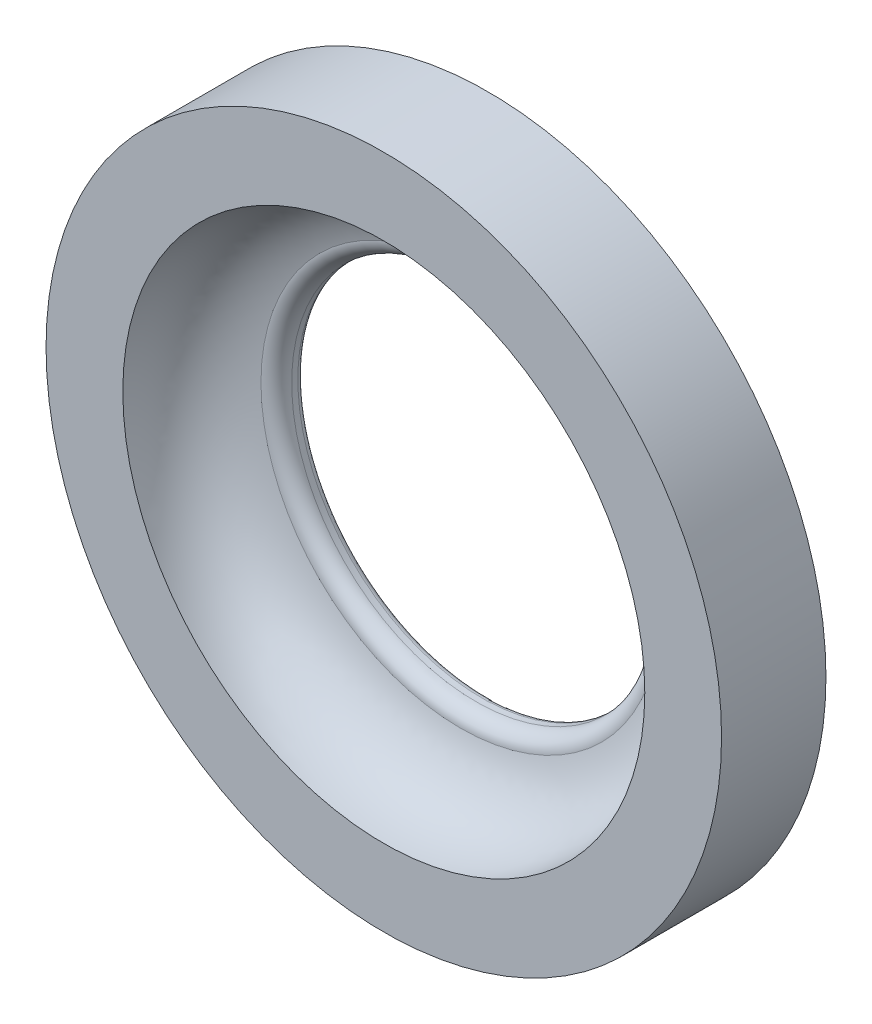
ISO-10303-21;
HEADER;
FILE_DESCRIPTION(('STEP AP214'),'2;1');
FILE_NAME('part.step','',(''),(''),'','','');
FILE_SCHEMA(('AUTOMOTIVE_DESIGN { 1 0 10303 214 1 1 1 1 }'));
ENDSEC;
DATA;
#1=APPLICATION_CONTEXT('core data for automotive mechanical design processes');
#2=APPLICATION_PROTOCOL_DEFINITION('international standard','automotive_design',2000,#1);
#3=PRODUCT_CONTEXT('',#1,'mechanical');
#4=PRODUCT('Part','Part','',(#3));
#5=PRODUCT_RELATED_PRODUCT_CATEGORY('part','',(#4));
#6=PRODUCT_DEFINITION_FORMATION('','',#4);
#7=PRODUCT_DEFINITION_CONTEXT('part definition',#1,'design');
#8=PRODUCT_DEFINITION('design','',#6,#7);
#9=PRODUCT_DEFINITION_SHAPE('','',#8);
#10=(LENGTH_UNIT() NAMED_UNIT(*) SI_UNIT(.MILLI.,.METRE.));
#11=(NAMED_UNIT(*) PLANE_ANGLE_UNIT() SI_UNIT($,.RADIAN.));
#12=(NAMED_UNIT(*) SI_UNIT($,.STERADIAN.) SOLID_ANGLE_UNIT());
#13=UNCERTAINTY_MEASURE_WITH_UNIT(LENGTH_MEASURE(1.E-05),#10,'distance_accuracy_value','');
#14=(GEOMETRIC_REPRESENTATION_CONTEXT(3) GLOBAL_UNCERTAINTY_ASSIGNED_CONTEXT((#13)) GLOBAL_UNIT_ASSIGNED_CONTEXT((#10,
#11,#12)) REPRESENTATION_CONTEXT('',''));
#15=CARTESIAN_POINT('',(0.,0.,0.));
#16=DIRECTION('',(0.,0.,1.));
#17=DIRECTION('',(1.,0.,0.));
#18=AXIS2_PLACEMENT_3D('',#15,#16,#17);
#19=CARTESIAN_POINT('',(-5.5,0.,0.));
#20=DIRECTION('',(0.,0.,-1.));
#21=DIRECTION('',(-1.,0.,0.));
#22=AXIS2_PLACEMENT_3D('',#19,#20,#21);
#23=PLANE('',#22);
#24=CARTESIAN_POINT('',(0.,0.,0.));
#25=DIRECTION('',(0.,0.,1.));
#26=DIRECTION('',(1.,0.,0.));
#27=AXIS2_PLACEMENT_3D('',#24,#25,#26);
#28=CIRCLE('',#27,4.25);
#29=CARTESIAN_POINT('',(4.25,0.,0.));
#30=VERTEX_POINT('',#29);
#31=EDGE_CURVE('E10',#30,#30,#28,.T.);
#32=ORIENTED_EDGE('',*,*,#31,.F.);
#33=EDGE_LOOP('',(#32));
#34=FACE_BOUND('',#33,.T.);
#35=CARTESIAN_POINT('',(0.,0.,0.));
#36=DIRECTION('',(0.,0.,1.));
#37=DIRECTION('',(1.,0.,0.));
#38=AXIS2_PLACEMENT_3D('',#35,#36,#37);
#39=CIRCLE('',#38,5.5);
#40=CARTESIAN_POINT('',(5.5,0.,0.));
#41=VERTEX_POINT('',#40);
#42=EDGE_CURVE('E55',#41,#41,#39,.T.);
#43=ORIENTED_EDGE('',*,*,#42,.T.);
#44=EDGE_LOOP('',(#43));
#45=FACE_BOUND('',#44,.T.);
#46=ADVANCED_FACE('F30',(#34,#45),#23,.F.);
#47=CARTESIAN_POINT('',(-4.25,0.,0.));
#48=CARTESIAN_POINT('',(-4.22684155176315,0.,-1.00547764541519));
#49=CARTESIAN_POINT('',(-3.25,0.,-1.25));
#50=B_SPLINE_CURVE_WITH_KNOTS('',2,(#47,#48,#49),.UNSPECIFIED.,.F.,.F.,(3,3),(0.,1.),.UNSPECIFIED.);
#51=CARTESIAN_POINT('',(0.,0.,0.));
#52=DIRECTION('',(0.,0.,1.));
#53=AXIS1_PLACEMENT('',#51,#52);
#54=SURFACE_OF_REVOLUTION('',#50,#53);
#55=CARTESIAN_POINT('',(0.,0.,-1.25));
#56=DIRECTION('',(0.,0.,1.));
#57=DIRECTION('',(1.,0.,0.));
#58=AXIS2_PLACEMENT_3D('',#55,#56,#57);
#59=CIRCLE('',#58,3.25);
#60=CARTESIAN_POINT('',(3.25,0.,-1.25));
#61=VERTEX_POINT('',#60);
#62=EDGE_CURVE('E36',#61,#61,#59,.T.);
#63=ORIENTED_EDGE('',*,*,#62,.F.);
#64=EDGE_LOOP('',(#63));
#65=FACE_BOUND('',#64,.T.);
#66=ORIENTED_EDGE('',*,*,#31,.T.);
#67=EDGE_LOOP('',(#66));
#68=FACE_BOUND('',#67,.T.);
#69=ADVANCED_FACE('F64',(#65,#68),#54,.T.);
#70=CARTESIAN_POINT('',(0.,0.,-1.5));
#71=DIRECTION('',(0.,0.,1.));
#72=DIRECTION('',(1.,0.,0.));
#73=AXIS2_PLACEMENT_3D('',#70,#71,#72);
#74=TOROIDAL_SURFACE('',#73,3.25,0.25);
#75=CARTESIAN_POINT('',(0.,0.,-1.5));
#76=DIRECTION('',(0.,0.,1.));
#77=DIRECTION('',(1.,0.,0.));
#78=AXIS2_PLACEMENT_3D('',#75,#76,#77);
#79=CIRCLE('',#78,3.);
#80=CARTESIAN_POINT('',(3.,0.,-1.5));
#81=VERTEX_POINT('',#80);
#82=EDGE_CURVE('E40',#81,#81,#79,.T.);
#83=ORIENTED_EDGE('',*,*,#82,.F.);
#84=EDGE_LOOP('',(#83));
#85=FACE_BOUND('',#84,.T.);
#86=ORIENTED_EDGE('',*,*,#62,.T.);
#87=EDGE_LOOP('',(#86));
#88=FACE_BOUND('',#87,.T.);
#89=ADVANCED_FACE('F67',(#85,#88),#74,.T.);
#90=CARTESIAN_POINT('',(0.,0.,0.));
#91=DIRECTION('',(0.,0.,1.));
#92=DIRECTION('',(1.,0.,0.));
#93=AXIS2_PLACEMENT_3D('',#90,#91,#92);
#94=CYLINDRICAL_SURFACE('',#93,3.);
#95=CARTESIAN_POINT('',(0.,0.,-1.6));
#96=DIRECTION('',(0.,0.,1.));
#97=DIRECTION('',(1.,0.,0.));
#98=AXIS2_PLACEMENT_3D('',#95,#96,#97);
#99=CIRCLE('',#98,3.);
#100=CARTESIAN_POINT('',(3.,0.,-1.6));
#101=VERTEX_POINT('',#100);
#102=EDGE_CURVE('E44',#101,#101,#99,.T.);
#103=ORIENTED_EDGE('',*,*,#102,.F.);
#104=EDGE_LOOP('',(#103));
#105=FACE_BOUND('',#104,.T.);
#106=ORIENTED_EDGE('',*,*,#82,.T.);
#107=EDGE_LOOP('',(#106));
#108=FACE_BOUND('',#107,.T.);
#109=ADVANCED_FACE('F71',(#105,#108),#94,.F.);
#110=CARTESIAN_POINT('',(0.,0.,-1.6));
#111=DIRECTION('',(0.,0.,1.));
#112=DIRECTION('',(1.,0.,0.));
#113=AXIS2_PLACEMENT_3D('',#110,#111,#112);
#114=TOROIDAL_SURFACE('',#113,3.1,0.0999999999999999);
#115=CARTESIAN_POINT('',(0.,0.,-1.7));
#116=DIRECTION('',(0.,0.,1.));
#117=DIRECTION('',(1.,0.,0.));
#118=AXIS2_PLACEMENT_3D('',#115,#116,#117);
#119=CIRCLE('',#118,3.1);
#120=CARTESIAN_POINT('',(3.1,0.,-1.7));
#121=VERTEX_POINT('',#120);
#122=EDGE_CURVE('E49',#121,#121,#119,.T.);
#123=ORIENTED_EDGE('',*,*,#122,.F.);
#124=EDGE_LOOP('',(#123));
#125=FACE_BOUND('',#124,.T.);
#126=ORIENTED_EDGE('',*,*,#102,.T.);
#127=EDGE_LOOP('',(#126));
#128=FACE_BOUND('',#127,.T.);
#129=ADVANCED_FACE('F75',(#125,#128),#114,.T.);
#130=CARTESIAN_POINT('',(-5.5,0.,-1.7));
#131=DIRECTION('',(0.,0.,1.));
#132=DIRECTION('',(1.,0.,0.));
#133=AXIS2_PLACEMENT_3D('',#130,#131,#132);
#134=PLANE('',#133);
#135=CARTESIAN_POINT('',(0.,0.,-1.7));
#136=DIRECTION('',(0.,0.,1.));
#137=DIRECTION('',(1.,0.,0.));
#138=AXIS2_PLACEMENT_3D('',#135,#136,#137);
#139=CIRCLE('',#138,5.5);
#140=CARTESIAN_POINT('',(5.5,0.,-1.7));
#141=VERTEX_POINT('',#140);
#142=EDGE_CURVE('E52',#141,#141,#139,.T.);
#143=ORIENTED_EDGE('',*,*,#142,.F.);
#144=EDGE_LOOP('',(#143));
#145=FACE_BOUND('',#144,.T.);
#146=ORIENTED_EDGE('',*,*,#122,.T.);
#147=EDGE_LOOP('',(#146));
#148=FACE_BOUND('',#147,.T.);
#149=ADVANCED_FACE('F79',(#145,#148),#134,.F.);
#150=CARTESIAN_POINT('',(0.,0.,0.));
#151=DIRECTION('',(0.,0.,1.));
#152=DIRECTION('',(1.,0.,0.));
#153=AXIS2_PLACEMENT_3D('',#150,#151,#152);
#154=CYLINDRICAL_SURFACE('',#153,5.5);
#155=ORIENTED_EDGE('',*,*,#42,.F.);
#156=EDGE_LOOP('',(#155));
#157=FACE_BOUND('',#156,.T.);
#158=ORIENTED_EDGE('',*,*,#142,.T.);
#159=EDGE_LOOP('',(#158));
#160=FACE_BOUND('',#159,.T.);
#161=ADVANCED_FACE('F83',(#157,#160),#154,.T.);
#162=CLOSED_SHELL('',(#46,#69,#89,#109,#129,#149,#161));
#163=MANIFOLD_SOLID_BREP('B2',#162);
#164=ADVANCED_BREP_SHAPE_REPRESENTATION('',(#18,#163),#14);
#165=SHAPE_DEFINITION_REPRESENTATION(#9,#164);
ENDSEC;
END-ISO-10303-21;
